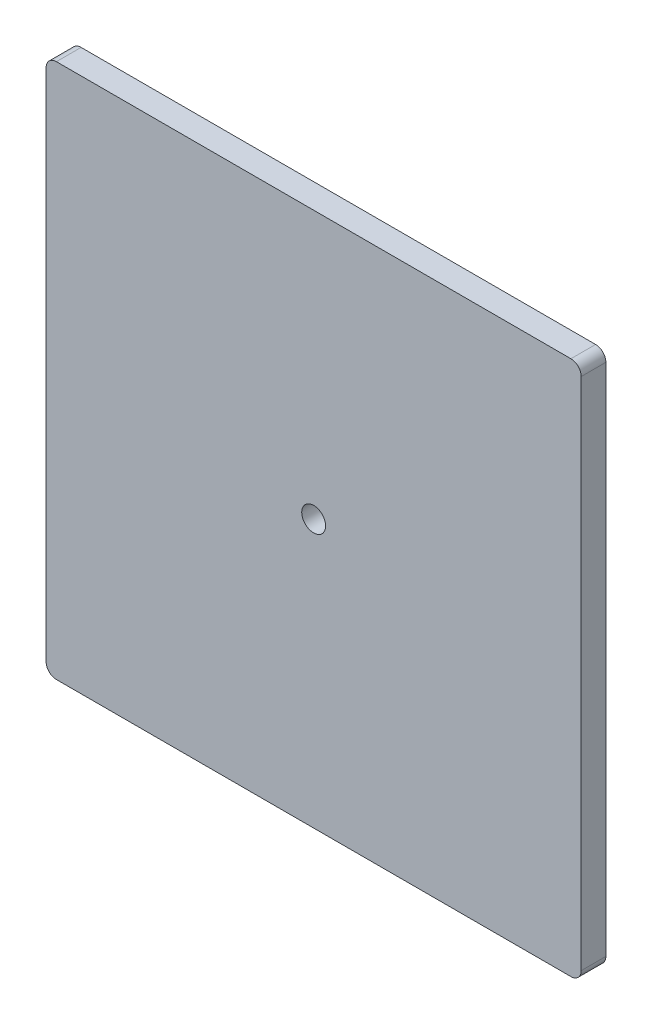
ISO-10303-21;
HEADER;
FILE_DESCRIPTION(('STEP AP214'),'2;1');
FILE_NAME('part.step','',(''),(''),'','','');
FILE_SCHEMA(('AUTOMOTIVE_DESIGN { 1 0 10303 214 1 1 1 1 }'));
ENDSEC;
DATA;
#1=APPLICATION_CONTEXT('core data for automotive mechanical design processes');
#2=APPLICATION_PROTOCOL_DEFINITION('international standard','automotive_design',2000,#1);
#3=PRODUCT_CONTEXT('',#1,'mechanical');
#4=PRODUCT('Part','Part','',(#3));
#5=PRODUCT_RELATED_PRODUCT_CATEGORY('part','',(#4));
#6=PRODUCT_DEFINITION_FORMATION('','',#4);
#7=PRODUCT_DEFINITION_CONTEXT('part definition',#1,'design');
#8=PRODUCT_DEFINITION('design','',#6,#7);
#9=PRODUCT_DEFINITION_SHAPE('','',#8);
#10=(LENGTH_UNIT() NAMED_UNIT(*) SI_UNIT(.MILLI.,.METRE.));
#11=(NAMED_UNIT(*) PLANE_ANGLE_UNIT() SI_UNIT($,.RADIAN.));
#12=(NAMED_UNIT(*) SI_UNIT($,.STERADIAN.) SOLID_ANGLE_UNIT());
#13=UNCERTAINTY_MEASURE_WITH_UNIT(LENGTH_MEASURE(1.E-05),#10,'distance_accuracy_value','');
#14=(GEOMETRIC_REPRESENTATION_CONTEXT(3) GLOBAL_UNCERTAINTY_ASSIGNED_CONTEXT((#13)) GLOBAL_UNIT_ASSIGNED_CONTEXT((#10,
#11,#12)) REPRESENTATION_CONTEXT('',''));
#15=CARTESIAN_POINT('',(0.,0.,0.));
#16=DIRECTION('',(0.,0.,1.));
#17=DIRECTION('',(1.,0.,0.));
#18=AXIS2_PLACEMENT_3D('',#15,#16,#17);
#19=CARTESIAN_POINT('',(-125.,125.,12.));
#20=DIRECTION('',(0.,0.,-1.));
#21=DIRECTION('',(-1.,0.,0.));
#22=AXIS2_PLACEMENT_3D('',#19,#20,#21);
#23=CYLINDRICAL_SURFACE('',#22,4.99999999999999);
#24=CARTESIAN_POINT('',(-125.,125.,0.));
#25=DIRECTION('',(0.,0.,1.));
#26=DIRECTION('',(1.,0.,0.));
#27=AXIS2_PLACEMENT_3D('',#24,#25,#26);
#28=CIRCLE('',#27,4.99999999999999);
#29=CARTESIAN_POINT('',(-125.,130.,0.));
#30=VERTEX_POINT('',#29);
#31=CARTESIAN_POINT('',(-130.,125.,0.));
#32=VERTEX_POINT('',#31);
#33=EDGE_CURVE('E142',#30,#32,#28,.T.);
#34=ORIENTED_EDGE('',*,*,#33,.T.);
#35=DIRECTION('',(0.,0.,-1.));
#36=VECTOR('',#35,1.);
#37=CARTESIAN_POINT('',(-130.,125.,12.));
#38=LINE('',#37,#36);
#39=CARTESIAN_POINT('',(-130.,125.,12.));
#40=VERTEX_POINT('',#39);
#41=EDGE_CURVE('E11',#40,#32,#38,.T.);
#42=ORIENTED_EDGE('',*,*,#41,.F.);
#43=CARTESIAN_POINT('',(-125.,125.,12.));
#44=DIRECTION('',(0.,0.,1.));
#45=DIRECTION('',(1.,0.,0.));
#46=AXIS2_PLACEMENT_3D('',#43,#44,#45);
#47=CIRCLE('',#46,4.99999999999999);
#48=CARTESIAN_POINT('',(-125.,130.,12.));
#49=VERTEX_POINT('',#48);
#50=EDGE_CURVE('E165',#49,#40,#47,.T.);
#51=ORIENTED_EDGE('',*,*,#50,.F.);
#52=DIRECTION('',(0.,0.,-1.));
#53=VECTOR('',#52,1.);
#54=CARTESIAN_POINT('',(-125.,130.,12.));
#55=LINE('',#54,#53);
#56=EDGE_CURVE('E138',#49,#30,#55,.T.);
#57=ORIENTED_EDGE('',*,*,#56,.T.);
#58=EDGE_LOOP('',(#34,#42,#51,#57));
#59=FACE_BOUND('',#58,.T.);
#60=ADVANCED_FACE('F41',(#59),#23,.T.);
#61=CARTESIAN_POINT('',(-130.,125.,12.));
#62=DIRECTION('',(1.,0.,0.));
#63=DIRECTION('',(0.,1.,0.));
#64=AXIS2_PLACEMENT_3D('',#61,#62,#63);
#65=PLANE('',#64);
#66=DIRECTION('',(0.,-1.,0.));
#67=VECTOR('',#66,1.);
#68=CARTESIAN_POINT('',(-130.,125.,0.));
#69=LINE('',#68,#67);
#70=CARTESIAN_POINT('',(-130.,-125.,0.));
#71=VERTEX_POINT('',#70);
#72=EDGE_CURVE('E146',#32,#71,#69,.T.);
#73=ORIENTED_EDGE('',*,*,#72,.T.);
#74=DIRECTION('',(0.,0.,-1.));
#75=VECTOR('',#74,1.);
#76=CARTESIAN_POINT('',(-130.,-125.,12.));
#77=LINE('',#76,#75);
#78=CARTESIAN_POINT('',(-130.,-125.,12.));
#79=VERTEX_POINT('',#78);
#80=EDGE_CURVE('E50',#79,#71,#77,.T.);
#81=ORIENTED_EDGE('',*,*,#80,.F.);
#82=DIRECTION('',(0.,-1.,0.));
#83=VECTOR('',#82,1.);
#84=CARTESIAN_POINT('',(-130.,125.,12.));
#85=LINE('',#84,#83);
#86=EDGE_CURVE('E101',#40,#79,#85,.T.);
#87=ORIENTED_EDGE('',*,*,#86,.F.);
#88=ORIENTED_EDGE('',*,*,#41,.T.);
#89=EDGE_LOOP('',(#73,#81,#87,#88));
#90=FACE_BOUND('',#89,.T.);
#91=ADVANCED_FACE('F235',(#90),#65,.F.);
#92=CARTESIAN_POINT('',(-125.,-125.,12.));
#93=DIRECTION('',(0.,0.,-1.));
#94=DIRECTION('',(-1.,0.,0.));
#95=AXIS2_PLACEMENT_3D('',#92,#93,#94);
#96=CYLINDRICAL_SURFACE('',#95,5.);
#97=CARTESIAN_POINT('',(-125.,-125.,0.));
#98=DIRECTION('',(0.,0.,1.));
#99=DIRECTION('',(-1.,0.,0.));
#100=AXIS2_PLACEMENT_3D('',#97,#98,#99);
#101=CIRCLE('',#100,5.);
#102=CARTESIAN_POINT('',(-125.,-130.,0.));
#103=VERTEX_POINT('',#102);
#104=EDGE_CURVE('E150',#71,#103,#101,.T.);
#105=ORIENTED_EDGE('',*,*,#104,.T.);
#106=DIRECTION('',(0.,0.,-1.));
#107=VECTOR('',#106,1.);
#108=CARTESIAN_POINT('',(-125.,-130.,12.));
#109=LINE('',#108,#107);
#110=CARTESIAN_POINT('',(-125.,-130.,12.));
#111=VERTEX_POINT('',#110);
#112=EDGE_CURVE('E176',#111,#103,#109,.T.);
#113=ORIENTED_EDGE('',*,*,#112,.F.);
#114=CARTESIAN_POINT('',(-125.,-125.,12.));
#115=DIRECTION('',(0.,0.,1.));
#116=DIRECTION('',(-1.,0.,0.));
#117=AXIS2_PLACEMENT_3D('',#114,#115,#116);
#118=CIRCLE('',#117,5.);
#119=EDGE_CURVE('E186',#79,#111,#118,.T.);
#120=ORIENTED_EDGE('',*,*,#119,.F.);
#121=ORIENTED_EDGE('',*,*,#80,.T.);
#122=EDGE_LOOP('',(#105,#113,#120,#121));
#123=FACE_BOUND('',#122,.T.);
#124=ADVANCED_FACE('F184',(#123),#96,.T.);
#125=CARTESIAN_POINT('',(-125.,-130.,12.));
#126=DIRECTION('',(0.,1.,0.));
#127=DIRECTION('',(0.,0.,1.));
#128=AXIS2_PLACEMENT_3D('',#125,#126,#127);
#129=PLANE('',#128);
#130=DIRECTION('',(1.,0.,0.));
#131=VECTOR('',#130,1.);
#132=CARTESIAN_POINT('',(-125.,-130.,0.));
#133=LINE('',#132,#131);
#134=CARTESIAN_POINT('',(125.,-130.,0.));
#135=VERTEX_POINT('',#134);
#136=EDGE_CURVE('E153',#103,#135,#133,.T.);
#137=ORIENTED_EDGE('',*,*,#136,.T.);
#138=DIRECTION('',(0.,0.,-1.));
#139=VECTOR('',#138,1.);
#140=CARTESIAN_POINT('',(125.,-130.,12.));
#141=LINE('',#140,#139);
#142=CARTESIAN_POINT('',(125.,-130.,12.));
#143=VERTEX_POINT('',#142);
#144=EDGE_CURVE('E172',#143,#135,#141,.T.);
#145=ORIENTED_EDGE('',*,*,#144,.F.);
#146=DIRECTION('',(1.,0.,0.));
#147=VECTOR('',#146,1.);
#148=CARTESIAN_POINT('',(-125.,-130.,12.));
#149=LINE('',#148,#147);
#150=EDGE_CURVE('E199',#111,#143,#149,.T.);
#151=ORIENTED_EDGE('',*,*,#150,.F.);
#152=ORIENTED_EDGE('',*,*,#112,.T.);
#153=EDGE_LOOP('',(#137,#145,#151,#152));
#154=FACE_BOUND('',#153,.T.);
#155=ADVANCED_FACE('F194',(#154),#129,.F.);
#156=CARTESIAN_POINT('',(125.,-125.,12.));
#157=DIRECTION('',(0.,0.,-1.));
#158=DIRECTION('',(-1.,0.,0.));
#159=AXIS2_PLACEMENT_3D('',#156,#157,#158);
#160=CYLINDRICAL_SURFACE('',#159,5.);
#161=CARTESIAN_POINT('',(125.,-125.,0.));
#162=DIRECTION('',(0.,0.,1.));
#163=DIRECTION('',(1.,0.,0.));
#164=AXIS2_PLACEMENT_3D('',#161,#162,#163);
#165=CIRCLE('',#164,5.);
#166=CARTESIAN_POINT('',(130.,-125.,0.));
#167=VERTEX_POINT('',#166);
#168=EDGE_CURVE('E156',#135,#167,#165,.T.);
#169=ORIENTED_EDGE('',*,*,#168,.T.);
#170=DIRECTION('',(0.,0.,-1.));
#171=VECTOR('',#170,1.);
#172=CARTESIAN_POINT('',(130.,-125.,12.));
#173=LINE('',#172,#171);
#174=CARTESIAN_POINT('',(130.,-125.,12.));
#175=VERTEX_POINT('',#174);
#176=EDGE_CURVE('E131',#175,#167,#173,.T.);
#177=ORIENTED_EDGE('',*,*,#176,.F.);
#178=CARTESIAN_POINT('',(125.,-125.,12.));
#179=DIRECTION('',(0.,0.,1.));
#180=DIRECTION('',(1.,0.,0.));
#181=AXIS2_PLACEMENT_3D('',#178,#179,#180);
#182=CIRCLE('',#181,5.);
#183=EDGE_CURVE('E120',#143,#175,#182,.T.);
#184=ORIENTED_EDGE('',*,*,#183,.F.);
#185=ORIENTED_EDGE('',*,*,#144,.T.);
#186=EDGE_LOOP('',(#169,#177,#184,#185));
#187=FACE_BOUND('',#186,.T.);
#188=ADVANCED_FACE('F197',(#187),#160,.T.);
#189=CARTESIAN_POINT('',(130.,125.,12.));
#190=DIRECTION('',(-1.,0.,0.));
#191=DIRECTION('',(0.,-1.,0.));
#192=AXIS2_PLACEMENT_3D('',#189,#190,#191);
#193=PLANE('',#192);
#194=DIRECTION('',(0.,1.,0.));
#195=VECTOR('',#194,1.);
#196=CARTESIAN_POINT('',(130.,125.,0.));
#197=LINE('',#196,#195);
#198=CARTESIAN_POINT('',(130.,125.,0.));
#199=VERTEX_POINT('',#198);
#200=EDGE_CURVE('E129',#167,#199,#197,.T.);
#201=ORIENTED_EDGE('',*,*,#200,.T.);
#202=DIRECTION('',(0.,0.,-1.));
#203=VECTOR('',#202,1.);
#204=CARTESIAN_POINT('',(130.,125.,12.));
#205=LINE('',#204,#203);
#206=CARTESIAN_POINT('',(130.,125.,12.));
#207=VERTEX_POINT('',#206);
#208=EDGE_CURVE('E126',#207,#199,#205,.T.);
#209=ORIENTED_EDGE('',*,*,#208,.F.);
#210=DIRECTION('',(0.,1.,0.));
#211=VECTOR('',#210,1.);
#212=CARTESIAN_POINT('',(130.,125.,12.));
#213=LINE('',#212,#211);
#214=EDGE_CURVE('E114',#175,#207,#213,.T.);
#215=ORIENTED_EDGE('',*,*,#214,.F.);
#216=ORIENTED_EDGE('',*,*,#176,.T.);
#217=EDGE_LOOP('',(#201,#209,#215,#216));
#218=FACE_BOUND('',#217,.T.);
#219=ADVANCED_FACE('F127',(#218),#193,.F.);
#220=CARTESIAN_POINT('',(125.,125.,12.));
#221=DIRECTION('',(0.,0.,-1.));
#222=DIRECTION('',(-1.,0.,0.));
#223=AXIS2_PLACEMENT_3D('',#220,#221,#222);
#224=CYLINDRICAL_SURFACE('',#223,5.);
#225=CARTESIAN_POINT('',(125.,125.,0.));
#226=DIRECTION('',(0.,0.,1.));
#227=DIRECTION('',(-1.,0.,0.));
#228=AXIS2_PLACEMENT_3D('',#225,#226,#227);
#229=CIRCLE('',#228,5.);
#230=CARTESIAN_POINT('',(125.,130.,0.));
#231=VERTEX_POINT('',#230);
#232=EDGE_CURVE('E87',#199,#231,#229,.T.);
#233=ORIENTED_EDGE('',*,*,#232,.T.);
#234=DIRECTION('',(0.,0.,-1.));
#235=VECTOR('',#234,1.);
#236=CARTESIAN_POINT('',(125.,130.,12.));
#237=LINE('',#236,#235);
#238=CARTESIAN_POINT('',(125.,130.,12.));
#239=VERTEX_POINT('',#238);
#240=EDGE_CURVE('E132',#239,#231,#237,.T.);
#241=ORIENTED_EDGE('',*,*,#240,.F.);
#242=CARTESIAN_POINT('',(125.,125.,12.));
#243=DIRECTION('',(0.,0.,1.));
#244=DIRECTION('',(-1.,0.,0.));
#245=AXIS2_PLACEMENT_3D('',#242,#243,#244);
#246=CIRCLE('',#245,5.);
#247=EDGE_CURVE('E118',#207,#239,#246,.T.);
#248=ORIENTED_EDGE('',*,*,#247,.F.);
#249=ORIENTED_EDGE('',*,*,#208,.T.);
#250=EDGE_LOOP('',(#233,#241,#248,#249));
#251=FACE_BOUND('',#250,.T.);
#252=ADVANCED_FACE('F134',(#251),#224,.T.);
#253=CARTESIAN_POINT('',(-125.,130.,12.));
#254=DIRECTION('',(0.,-1.,0.));
#255=DIRECTION('',(0.,0.,-1.));
#256=AXIS2_PLACEMENT_3D('',#253,#254,#255);
#257=PLANE('',#256);
#258=DIRECTION('',(-1.,0.,0.));
#259=VECTOR('',#258,1.);
#260=CARTESIAN_POINT('',(-125.,130.,0.));
#261=LINE('',#260,#259);
#262=EDGE_CURVE('E93',#231,#30,#261,.T.);
#263=ORIENTED_EDGE('',*,*,#262,.T.);
#264=ORIENTED_EDGE('',*,*,#56,.F.);
#265=DIRECTION('',(-1.,0.,0.));
#266=VECTOR('',#265,1.);
#267=CARTESIAN_POINT('',(-125.,130.,12.));
#268=LINE('',#267,#266);
#269=EDGE_CURVE('E58',#239,#49,#268,.T.);
#270=ORIENTED_EDGE('',*,*,#269,.F.);
#271=ORIENTED_EDGE('',*,*,#240,.T.);
#272=EDGE_LOOP('',(#263,#264,#270,#271));
#273=FACE_BOUND('',#272,.T.);
#274=ADVANCED_FACE('F226',(#273),#257,.F.);
#275=CARTESIAN_POINT('',(-125.,125.,12.));
#276=DIRECTION('',(0.,0.,1.));
#277=DIRECTION('',(1.,0.,0.));
#278=AXIS2_PLACEMENT_3D('',#275,#276,#277);
#279=PLANE('',#278);
#280=CARTESIAN_POINT('',(0.,0.,12.));
#281=DIRECTION('',(0.,0.,1.));
#282=DIRECTION('',(1.,0.,0.));
#283=AXIS2_PLACEMENT_3D('',#280,#281,#282);
#284=CIRCLE('',#283,5.795);
#285=CARTESIAN_POINT('',(5.795,0.,12.));
#286=VERTEX_POINT('',#285);
#287=EDGE_CURVE('E209',#286,#286,#284,.T.);
#288=ORIENTED_EDGE('',*,*,#287,.F.);
#289=EDGE_LOOP('',(#288));
#290=FACE_BOUND('',#289,.T.);
#291=ORIENTED_EDGE('',*,*,#50,.T.);
#292=ORIENTED_EDGE('',*,*,#86,.T.);
#293=ORIENTED_EDGE('',*,*,#119,.T.);
#294=ORIENTED_EDGE('',*,*,#150,.T.);
#295=ORIENTED_EDGE('',*,*,#183,.T.);
#296=ORIENTED_EDGE('',*,*,#214,.T.);
#297=ORIENTED_EDGE('',*,*,#247,.T.);
#298=ORIENTED_EDGE('',*,*,#269,.T.);
#299=EDGE_LOOP('',(#291,#292,#293,#294,#295,#296,#297,#298));
#300=FACE_BOUND('',#299,.T.);
#301=ADVANCED_FACE('F116',(#290,#300),#279,.T.);
#302=CARTESIAN_POINT('',(-125.,125.,0.));
#303=DIRECTION('',(0.,0.,1.));
#304=DIRECTION('',(1.,0.,0.));
#305=AXIS2_PLACEMENT_3D('',#302,#303,#304);
#306=PLANE('',#305);
#307=ORIENTED_EDGE('',*,*,#33,.F.);
#308=ORIENTED_EDGE('',*,*,#262,.F.);
#309=ORIENTED_EDGE('',*,*,#232,.F.);
#310=ORIENTED_EDGE('',*,*,#200,.F.);
#311=ORIENTED_EDGE('',*,*,#168,.F.);
#312=ORIENTED_EDGE('',*,*,#136,.F.);
#313=ORIENTED_EDGE('',*,*,#104,.F.);
#314=ORIENTED_EDGE('',*,*,#72,.F.);
#315=EDGE_LOOP('',(#307,#308,#309,#310,#311,#312,#313,#314));
#316=FACE_BOUND('',#315,.T.);
#317=ADVANCED_FACE('F190',(#316),#306,.F.);
#318=CARTESIAN_POINT('',(0.,0.,2.));
#319=DIRECTION('',(0.,0.,1.));
#320=DIRECTION('',(1.,0.,0.));
#321=AXIS2_PLACEMENT_3D('',#318,#319,#320);
#322=CYLINDRICAL_SURFACE('',#321,5.795);
#323=CARTESIAN_POINT('',(0.,0.,2.));
#324=DIRECTION('',(0.,0.,1.));
#325=DIRECTION('',(1.,0.,0.));
#326=AXIS2_PLACEMENT_3D('',#323,#324,#325);
#327=CIRCLE('',#326,5.795);
#328=CARTESIAN_POINT('',(5.795,0.,2.));
#329=VERTEX_POINT('',#328);
#330=EDGE_CURVE('E147',#329,#329,#327,.T.);
#331=ORIENTED_EDGE('',*,*,#330,.F.);
#332=EDGE_LOOP('',(#331));
#333=FACE_BOUND('',#332,.T.);
#334=ORIENTED_EDGE('',*,*,#287,.T.);
#335=EDGE_LOOP('',(#334));
#336=FACE_BOUND('',#335,.T.);
#337=ADVANCED_FACE('F219',(#333,#336),#322,.F.);
#338=CARTESIAN_POINT('',(0.,0.,2.));
#339=DIRECTION('',(0.,0.,1.));
#340=DIRECTION('',(1.,0.,0.));
#341=AXIS2_PLACEMENT_3D('',#338,#339,#340);
#342=PLANE('',#341);
#343=ORIENTED_EDGE('',*,*,#330,.T.);
#344=EDGE_LOOP('',(#343));
#345=FACE_BOUND('',#344,.T.);
#346=ADVANCED_FACE('F217',(#345),#342,.T.);
#347=CLOSED_SHELL('',(#60,#91,#124,#155,#188,#219,#252,#274,#301,#317,#337,#346));
#348=MANIFOLD_SOLID_BREP('B2',#347);
#349=ADVANCED_BREP_SHAPE_REPRESENTATION('',(#18,#348),#14);
#350=SHAPE_DEFINITION_REPRESENTATION(#9,#349);
ENDSEC;
END-ISO-10303-21;
